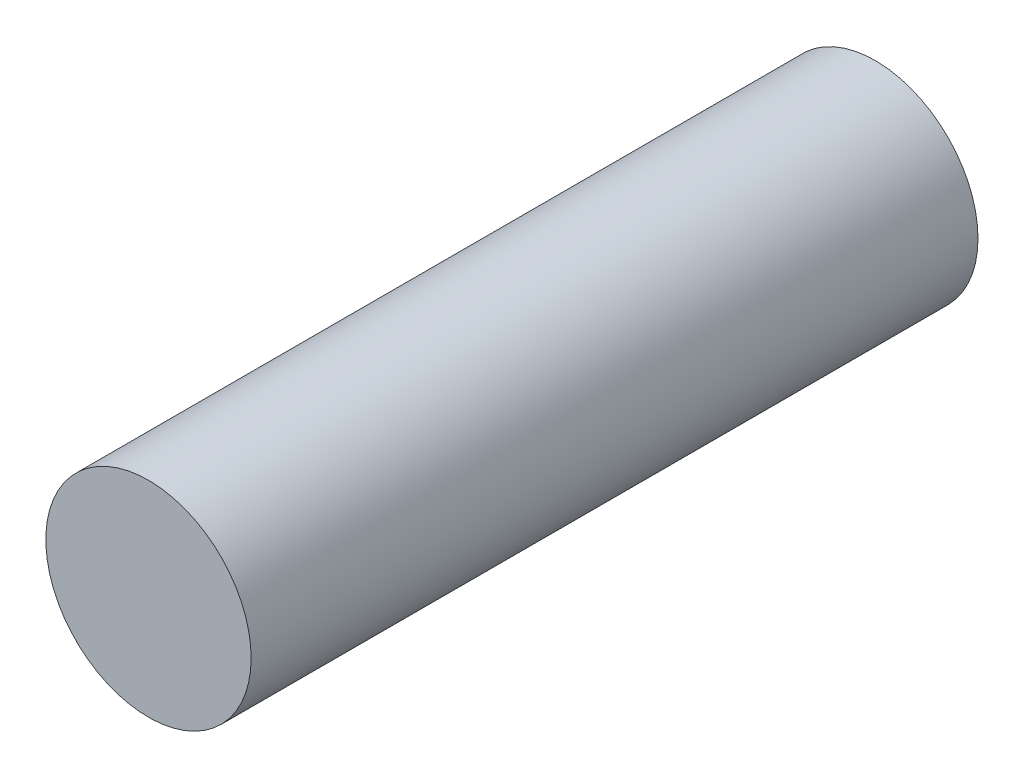
ISO-10303-21;
HEADER;
FILE_DESCRIPTION(('STEP AP214'),'2;1');
FILE_NAME('part.step','',(''),(''),'','','');
FILE_SCHEMA(('AUTOMOTIVE_DESIGN { 1 0 10303 214 1 1 1 1 }'));
ENDSEC;
DATA;
#1=APPLICATION_CONTEXT('core data for automotive mechanical design processes');
#2=APPLICATION_PROTOCOL_DEFINITION('international standard','automotive_design',2000,#1);
#3=PRODUCT_CONTEXT('',#1,'mechanical');
#4=PRODUCT('Part','Part','',(#3));
#5=PRODUCT_RELATED_PRODUCT_CATEGORY('part','',(#4));
#6=PRODUCT_DEFINITION_FORMATION('','',#4);
#7=PRODUCT_DEFINITION_CONTEXT('part definition',#1,'design');
#8=PRODUCT_DEFINITION('design','',#6,#7);
#9=PRODUCT_DEFINITION_SHAPE('','',#8);
#10=(LENGTH_UNIT() NAMED_UNIT(*) SI_UNIT(.MILLI.,.METRE.));
#11=(NAMED_UNIT(*) PLANE_ANGLE_UNIT() SI_UNIT($,.RADIAN.));
#12=(NAMED_UNIT(*) SI_UNIT($,.STERADIAN.) SOLID_ANGLE_UNIT());
#13=UNCERTAINTY_MEASURE_WITH_UNIT(LENGTH_MEASURE(1.E-05),#10,'distance_accuracy_value','');
#14=(GEOMETRIC_REPRESENTATION_CONTEXT(3) GLOBAL_UNCERTAINTY_ASSIGNED_CONTEXT((#13)) GLOBAL_UNIT_ASSIGNED_CONTEXT((#10,
#11,#12)) REPRESENTATION_CONTEXT('',''));
#15=CARTESIAN_POINT('',(0.,0.,0.));
#16=DIRECTION('',(0.,0.,1.));
#17=DIRECTION('',(1.,0.,0.));
#18=AXIS2_PLACEMENT_3D('',#15,#16,#17);
#19=CARTESIAN_POINT('',(0.,0.,65.5));
#20=DIRECTION('',(0.,0.,-1.));
#21=DIRECTION('',(-1.,0.,0.));
#22=AXIS2_PLACEMENT_3D('',#19,#20,#21);
#23=CYLINDRICAL_SURFACE('',#22,9.25);
#24=CARTESIAN_POINT('',(0.,0.,65.5));
#25=DIRECTION('',(0.,0.,1.));
#26=DIRECTION('',(1.,0.,0.));
#27=AXIS2_PLACEMENT_3D('',#24,#25,#26);
#28=CIRCLE('',#27,9.25);
#29=CARTESIAN_POINT('',(9.25,0.,65.5));
#30=VERTEX_POINT('',#29);
#31=EDGE_CURVE('E10',#30,#30,#28,.T.);
#32=ORIENTED_EDGE('',*,*,#31,.F.);
#33=EDGE_LOOP('',(#32));
#34=FACE_BOUND('',#33,.T.);
#35=CARTESIAN_POINT('',(0.,0.,0.));
#36=DIRECTION('',(0.,0.,1.));
#37=DIRECTION('',(1.,0.,0.));
#38=AXIS2_PLACEMENT_3D('',#35,#36,#37);
#39=CIRCLE('',#38,9.25);
#40=CARTESIAN_POINT('',(9.25,0.,0.));
#41=VERTEX_POINT('',#40);
#42=EDGE_CURVE('E33',#41,#41,#39,.T.);
#43=ORIENTED_EDGE('',*,*,#42,.T.);
#44=EDGE_LOOP('',(#43));
#45=FACE_BOUND('',#44,.T.);
#46=ADVANCED_FACE('F30',(#34,#45),#23,.T.);
#47=CARTESIAN_POINT('',(0.,0.,65.5));
#48=DIRECTION('',(0.,0.,1.));
#49=DIRECTION('',(1.,0.,0.));
#50=AXIS2_PLACEMENT_3D('',#47,#48,#49);
#51=PLANE('',#50);
#52=ORIENTED_EDGE('',*,*,#31,.T.);
#53=EDGE_LOOP('',(#52));
#54=FACE_BOUND('',#53,.T.);
#55=ADVANCED_FACE('F45',(#54),#51,.T.);
#56=CARTESIAN_POINT('',(0.,0.,0.));
#57=DIRECTION('',(0.,0.,1.));
#58=DIRECTION('',(1.,0.,0.));
#59=AXIS2_PLACEMENT_3D('',#56,#57,#58);
#60=PLANE('',#59);
#61=ORIENTED_EDGE('',*,*,#42,.F.);
#62=EDGE_LOOP('',(#61));
#63=FACE_BOUND('',#62,.T.);
#64=ADVANCED_FACE('F43',(#63),#60,.F.);
#65=CLOSED_SHELL('',(#46,#55,#64));
#66=MANIFOLD_SOLID_BREP('B2',#65);
#67=ADVANCED_BREP_SHAPE_REPRESENTATION('',(#18,#66),#14);
#68=SHAPE_DEFINITION_REPRESENTATION(#9,#67);
ENDSEC;
END-ISO-10303-21;
